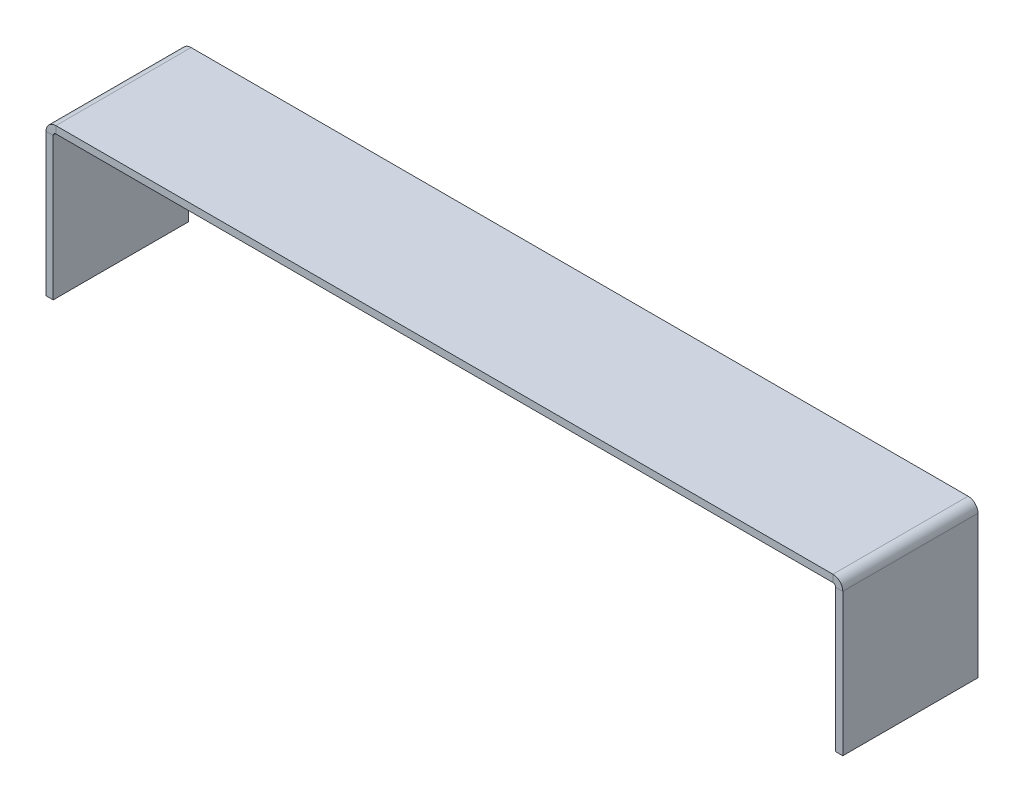
ISO-10303-21;
HEADER;
FILE_DESCRIPTION(('STEP AP214'),'2;1');
FILE_NAME('part.step','',(''),(''),'','','');
FILE_SCHEMA(('AUTOMOTIVE_DESIGN { 1 0 10303 214 1 1 1 1 }'));
ENDSEC;
DATA;
#1=APPLICATION_CONTEXT('core data for automotive mechanical design processes');
#2=APPLICATION_PROTOCOL_DEFINITION('international standard','automotive_design',2000,#1);
#3=PRODUCT_CONTEXT('',#1,'mechanical');
#4=PRODUCT('Part','Part','',(#3));
#5=PRODUCT_RELATED_PRODUCT_CATEGORY('part','',(#4));
#6=PRODUCT_DEFINITION_FORMATION('','',#4);
#7=PRODUCT_DEFINITION_CONTEXT('part definition',#1,'design');
#8=PRODUCT_DEFINITION('design','',#6,#7);
#9=PRODUCT_DEFINITION_SHAPE('','',#8);
#10=(LENGTH_UNIT() NAMED_UNIT(*) SI_UNIT(.MILLI.,.METRE.));
#11=(NAMED_UNIT(*) PLANE_ANGLE_UNIT() SI_UNIT($,.RADIAN.));
#12=(NAMED_UNIT(*) SI_UNIT($,.STERADIAN.) SOLID_ANGLE_UNIT());
#13=UNCERTAINTY_MEASURE_WITH_UNIT(LENGTH_MEASURE(1.E-05),#10,'distance_accuracy_value','');
#14=(GEOMETRIC_REPRESENTATION_CONTEXT(3) GLOBAL_UNCERTAINTY_ASSIGNED_CONTEXT((#13)) GLOBAL_UNIT_ASSIGNED_CONTEXT((#10,
#11,#12)) REPRESENTATION_CONTEXT('',''));
#15=CARTESIAN_POINT('',(0.,0.,0.));
#16=DIRECTION('',(0.,0.,1.));
#17=DIRECTION('',(1.,0.,0.));
#18=AXIS2_PLACEMENT_3D('',#15,#16,#17);
#19=CARTESIAN_POINT('',(150.,-2.,18.75));
#20=DIRECTION('',(0.,0.,1.));
#21=DIRECTION('',(1.,0.,0.));
#22=AXIS2_PLACEMENT_3D('',#19,#20,#21);
#23=PLANE('',#22);
#24=DIRECTION('',(-1.,0.,0.));
#25=VECTOR('',#24,1.);
#26=CARTESIAN_POINT('',(150.,-2.,18.75));
#27=LINE('',#26,#25);
#28=CARTESIAN_POINT('',(107.7634,-2.,18.75));
#29=VERTEX_POINT('',#28);
#30=CARTESIAN_POINT('',(-107.7634,-2.,18.75));
#31=VERTEX_POINT('',#30);
#32=EDGE_CURVE('E68',#29,#31,#27,.T.);
#33=ORIENTED_EDGE('',*,*,#32,.F.);
#34=DIRECTION('',(0.,1.,0.));
#35=VECTOR('',#34,1.);
#36=CARTESIAN_POINT('',(107.7634,-2.,18.75));
#37=LINE('',#36,#35);
#38=CARTESIAN_POINT('',(107.7634,0.,18.75));
#39=VERTEX_POINT('',#38);
#40=EDGE_CURVE('E242',#29,#39,#37,.T.);
#41=ORIENTED_EDGE('',*,*,#40,.T.);
#42=DIRECTION('',(-1.,0.,0.));
#43=VECTOR('',#42,1.);
#44=CARTESIAN_POINT('',(150.,0.,18.75));
#45=LINE('',#44,#43);
#46=CARTESIAN_POINT('',(-107.7634,0.,18.75));
#47=VERTEX_POINT('',#46);
#48=EDGE_CURVE('E247',#39,#47,#45,.T.);
#49=ORIENTED_EDGE('',*,*,#48,.T.);
#50=DIRECTION('',(0.,1.,0.));
#51=VECTOR('',#50,1.);
#52=CARTESIAN_POINT('',(-107.7634,-2.,18.75));
#53=LINE('',#52,#51);
#54=EDGE_CURVE('E236',#31,#47,#53,.T.);
#55=ORIENTED_EDGE('',*,*,#54,.F.);
#56=EDGE_LOOP('',(#33,#41,#49,#55));
#57=FACE_BOUND('',#56,.T.);
#58=ADVANCED_FACE('F45',(#57),#23,.T.);
#59=CARTESIAN_POINT('',(150.,0.,18.75));
#60=DIRECTION('',(0.,1.,0.));
#61=DIRECTION('',(0.,0.,1.));
#62=AXIS2_PLACEMENT_3D('',#59,#60,#61);
#63=PLANE('',#62);
#64=ORIENTED_EDGE('',*,*,#48,.F.);
#65=DIRECTION('',(0.,0.,-1.));
#66=VECTOR('',#65,1.);
#67=CARTESIAN_POINT('',(107.7634,0.,18.75));
#68=LINE('',#67,#66);
#69=CARTESIAN_POINT('',(107.7634,0.,-18.75));
#70=VERTEX_POINT('',#69);
#71=EDGE_CURVE('E239',#39,#70,#68,.T.);
#72=ORIENTED_EDGE('',*,*,#71,.T.);
#73=DIRECTION('',(-1.,0.,0.));
#74=VECTOR('',#73,1.);
#75=CARTESIAN_POINT('',(150.,0.,-18.75));
#76=LINE('',#75,#74);
#77=CARTESIAN_POINT('',(-107.7634,0.,-18.75));
#78=VERTEX_POINT('',#77);
#79=EDGE_CURVE('E49',#70,#78,#76,.T.);
#80=ORIENTED_EDGE('',*,*,#79,.T.);
#81=DIRECTION('',(0.,0.,-1.));
#82=VECTOR('',#81,1.);
#83=CARTESIAN_POINT('',(-107.7634,0.,18.75));
#84=LINE('',#83,#82);
#85=EDGE_CURVE('E227',#47,#78,#84,.T.);
#86=ORIENTED_EDGE('',*,*,#85,.F.);
#87=EDGE_LOOP('',(#64,#72,#80,#86));
#88=FACE_BOUND('',#87,.T.);
#89=ADVANCED_FACE('F254',(#88),#63,.T.);
#90=CARTESIAN_POINT('',(150.,0.,-18.75));
#91=DIRECTION('',(0.,0.,-1.));
#92=DIRECTION('',(-1.,0.,0.));
#93=AXIS2_PLACEMENT_3D('',#90,#91,#92);
#94=PLANE('',#93);
#95=ORIENTED_EDGE('',*,*,#79,.F.);
#96=DIRECTION('',(0.,-1.,0.));
#97=VECTOR('',#96,1.);
#98=CARTESIAN_POINT('',(107.7634,0.,-18.75));
#99=LINE('',#98,#97);
#100=CARTESIAN_POINT('',(107.7634,-2.,-18.75));
#101=VERTEX_POINT('',#100);
#102=EDGE_CURVE('E12',#70,#101,#99,.T.);
#103=ORIENTED_EDGE('',*,*,#102,.T.);
#104=DIRECTION('',(-1.,0.,0.));
#105=VECTOR('',#104,1.);
#106=CARTESIAN_POINT('',(150.,-2.,-18.75));
#107=LINE('',#106,#105);
#108=CARTESIAN_POINT('',(-107.7634,-2.,-18.75));
#109=VERTEX_POINT('',#108);
#110=EDGE_CURVE('E231',#101,#109,#107,.T.);
#111=ORIENTED_EDGE('',*,*,#110,.T.);
#112=DIRECTION('',(0.,-1.,0.));
#113=VECTOR('',#112,1.);
#114=CARTESIAN_POINT('',(-107.7634,0.,-18.75));
#115=LINE('',#114,#113);
#116=EDGE_CURVE('E230',#78,#109,#115,.T.);
#117=ORIENTED_EDGE('',*,*,#116,.F.);
#118=EDGE_LOOP('',(#95,#103,#111,#117));
#119=FACE_BOUND('',#118,.T.);
#120=ADVANCED_FACE('F47',(#119),#94,.T.);
#121=CARTESIAN_POINT('',(150.,-2.,18.75));
#122=DIRECTION('',(0.,1.,0.));
#123=DIRECTION('',(0.,0.,1.));
#124=AXIS2_PLACEMENT_3D('',#121,#122,#123);
#125=PLANE('',#124);
#126=DIRECTION('',(0.,0.,-1.));
#127=VECTOR('',#126,1.);
#128=CARTESIAN_POINT('',(107.7634,-2.,18.75));
#129=LINE('',#128,#127);
#130=EDGE_CURVE('E54',#29,#101,#129,.T.);
#131=ORIENTED_EDGE('',*,*,#130,.F.);
#132=ORIENTED_EDGE('',*,*,#32,.T.);
#133=DIRECTION('',(0.,0.,-1.));
#134=VECTOR('',#133,1.);
#135=CARTESIAN_POINT('',(-107.7634,-2.,18.75));
#136=LINE('',#135,#134);
#137=EDGE_CURVE('E234',#31,#109,#136,.T.);
#138=ORIENTED_EDGE('',*,*,#137,.T.);
#139=ORIENTED_EDGE('',*,*,#110,.F.);
#140=EDGE_LOOP('',(#131,#132,#138,#139));
#141=FACE_BOUND('',#140,.T.);
#142=ADVANCED_FACE('F307',(#141),#125,.F.);
#143=CARTESIAN_POINT('',(-107.7634,-2.7366,18.75));
#144=DIRECTION('',(0.,0.,1.));
#145=DIRECTION('',(1.,0.,0.));
#146=AXIS2_PLACEMENT_3D('',#143,#144,#145);
#147=PLANE('',#146);
#148=DIRECTION('',(-1.,0.,0.));
#149=VECTOR('',#148,1.);
#150=CARTESIAN_POINT('',(-108.5,-2.73659999999999,18.75));
#151=LINE('',#150,#149);
#152=CARTESIAN_POINT('',(-108.5,-2.73659999999999,18.75));
#153=VERTEX_POINT('',#152);
#154=CARTESIAN_POINT('',(-110.5,-2.73659999999997,18.75));
#155=VERTEX_POINT('',#154);
#156=EDGE_CURVE('E189',#153,#155,#151,.T.);
#157=ORIENTED_EDGE('',*,*,#156,.F.);
#158=CARTESIAN_POINT('',(-107.7634,-2.7366,18.75));
#159=DIRECTION('',(0.,0.,1.));
#160=DIRECTION('',(1.,0.,0.));
#161=AXIS2_PLACEMENT_3D('',#158,#159,#160);
#162=CIRCLE('',#161,0.7366);
#163=EDGE_CURVE('E188',#153,#31,#162,.F.);
#164=ORIENTED_EDGE('',*,*,#163,.T.);
#165=ORIENTED_EDGE('',*,*,#54,.T.);
#166=CARTESIAN_POINT('',(-107.7634,-2.7366,18.75));
#167=DIRECTION('',(0.,0.,-1.));
#168=DIRECTION('',(1.,0.,0.));
#169=AXIS2_PLACEMENT_3D('',#166,#167,#168);
#170=CIRCLE('',#169,2.7366);
#171=EDGE_CURVE('E216',#155,#47,#170,.T.);
#172=ORIENTED_EDGE('',*,*,#171,.F.);
#173=EDGE_LOOP('',(#157,#164,#165,#172));
#174=FACE_BOUND('',#173,.T.);
#175=ADVANCED_FACE('F281',(#174),#147,.T.);
#176=CARTESIAN_POINT('',(-107.7634,-2.7366,-18.75));
#177=DIRECTION('',(0.,0.,-1.));
#178=DIRECTION('',(-1.,0.,0.));
#179=AXIS2_PLACEMENT_3D('',#176,#177,#178);
#180=PLANE('',#179);
#181=CARTESIAN_POINT('',(-107.7634,-2.7366,-18.75));
#182=DIRECTION('',(0.,0.,1.));
#183=DIRECTION('',(1.,0.,0.));
#184=AXIS2_PLACEMENT_3D('',#181,#182,#183);
#185=CIRCLE('',#184,0.7366);
#186=CARTESIAN_POINT('',(-108.5,-2.73659999999999,-18.75));
#187=VERTEX_POINT('',#186);
#188=EDGE_CURVE('E220',#109,#187,#185,.T.);
#189=ORIENTED_EDGE('',*,*,#188,.T.);
#190=DIRECTION('',(1.,0.,0.));
#191=VECTOR('',#190,1.);
#192=CARTESIAN_POINT('',(-110.5,-2.73660000000001,-18.75));
#193=LINE('',#192,#191);
#194=CARTESIAN_POINT('',(-110.5,-2.73660000000001,-18.75));
#195=VERTEX_POINT('',#194);
#196=EDGE_CURVE('E198',#195,#187,#193,.T.);
#197=ORIENTED_EDGE('',*,*,#196,.F.);
#198=CARTESIAN_POINT('',(-107.7634,-2.7366,-18.75));
#199=DIRECTION('',(0.,0.,1.));
#200=DIRECTION('',(1.,0.,0.));
#201=AXIS2_PLACEMENT_3D('',#198,#199,#200);
#202=CIRCLE('',#201,2.7366);
#203=EDGE_CURVE('E219',#78,#195,#202,.T.);
#204=ORIENTED_EDGE('',*,*,#203,.F.);
#205=ORIENTED_EDGE('',*,*,#116,.T.);
#206=EDGE_LOOP('',(#189,#197,#204,#205));
#207=FACE_BOUND('',#206,.T.);
#208=ADVANCED_FACE('F266',(#207),#180,.T.);
#209=CARTESIAN_POINT('',(-107.7634,-2.7366,-37.652239479273));
#210=DIRECTION('',(0.,0.,1.));
#211=DIRECTION('',(1.,0.,0.));
#212=AXIS2_PLACEMENT_3D('',#209,#210,#211);
#213=CYLINDRICAL_SURFACE('',#212,2.7366);
#214=ORIENTED_EDGE('',*,*,#85,.T.);
#215=ORIENTED_EDGE('',*,*,#203,.T.);
#216=DIRECTION('',(0.,0.,-1.));
#217=VECTOR('',#216,1.);
#218=CARTESIAN_POINT('',(-110.5,-2.73660000000001,18.75));
#219=LINE('',#218,#217);
#220=EDGE_CURVE('E203',#155,#195,#219,.T.);
#221=ORIENTED_EDGE('',*,*,#220,.F.);
#222=ORIENTED_EDGE('',*,*,#171,.T.);
#223=EDGE_LOOP('',(#214,#215,#221,#222));
#224=FACE_BOUND('',#223,.T.);
#225=ADVANCED_FACE('F262',(#224),#213,.T.);
#226=CARTESIAN_POINT('',(-107.7634,-2.7366,-37.652239479273));
#227=DIRECTION('',(0.,0.,1.));
#228=DIRECTION('',(1.,0.,0.));
#229=AXIS2_PLACEMENT_3D('',#226,#227,#228);
#230=CYLINDRICAL_SURFACE('',#229,0.7366);
#231=ORIENTED_EDGE('',*,*,#137,.F.);
#232=ORIENTED_EDGE('',*,*,#163,.F.);
#233=DIRECTION('',(0.,0.,-1.));
#234=VECTOR('',#233,1.);
#235=CARTESIAN_POINT('',(-108.5,-2.73659999999999,18.75));
#236=LINE('',#235,#234);
#237=EDGE_CURVE('E181',#153,#187,#236,.T.);
#238=ORIENTED_EDGE('',*,*,#237,.T.);
#239=ORIENTED_EDGE('',*,*,#188,.F.);
#240=EDGE_LOOP('',(#231,#232,#238,#239));
#241=FACE_BOUND('',#240,.T.);
#242=ADVANCED_FACE('F275',(#241),#230,.F.);
#243=CARTESIAN_POINT('',(-110.5,-42.245355098888,0.));
#244=DIRECTION('',(0.,-1.,0.));
#245=DIRECTION('',(0.,0.,1.));
#246=AXIS2_PLACEMENT_3D('',#243,#244,#245);
#247=PLANE('',#246);
#248=DIRECTION('',(0.,0.,-1.));
#249=VECTOR('',#248,1.);
#250=CARTESIAN_POINT('',(-108.5,-42.245355098888,18.75));
#251=LINE('',#250,#249);
#252=CARTESIAN_POINT('',(-108.5,-42.245355098888,18.75));
#253=VERTEX_POINT('',#252);
#254=CARTESIAN_POINT('',(-108.5,-42.245355098888,-18.75));
#255=VERTEX_POINT('',#254);
#256=EDGE_CURVE('E191',#253,#255,#251,.T.);
#257=ORIENTED_EDGE('',*,*,#256,.F.);
#258=DIRECTION('',(-1.,0.,0.));
#259=VECTOR('',#258,1.);
#260=CARTESIAN_POINT('',(-108.5,-42.245355098888,18.75));
#261=LINE('',#260,#259);
#262=CARTESIAN_POINT('',(-110.5,-42.245355098888,18.75));
#263=VERTEX_POINT('',#262);
#264=EDGE_CURVE('E211',#253,#263,#261,.T.);
#265=ORIENTED_EDGE('',*,*,#264,.T.);
#266=DIRECTION('',(0.,0.,-1.));
#267=VECTOR('',#266,1.);
#268=CARTESIAN_POINT('',(-110.5,-42.245355098888,18.75));
#269=LINE('',#268,#267);
#270=CARTESIAN_POINT('',(-110.5,-42.245355098888,-18.75));
#271=VERTEX_POINT('',#270);
#272=EDGE_CURVE('E208',#263,#271,#269,.T.);
#273=ORIENTED_EDGE('',*,*,#272,.T.);
#274=DIRECTION('',(1.,0.,0.));
#275=VECTOR('',#274,1.);
#276=CARTESIAN_POINT('',(-110.5,-42.245355098888,-18.75));
#277=LINE('',#276,#275);
#278=EDGE_CURVE('E205',#271,#255,#277,.T.);
#279=ORIENTED_EDGE('',*,*,#278,.T.);
#280=EDGE_LOOP('',(#257,#265,#273,#279));
#281=FACE_BOUND('',#280,.T.);
#282=ADVANCED_FACE('F290',(#281),#247,.T.);
#283=CARTESIAN_POINT('',(-110.500000000001,257.754644901112,18.75));
#284=DIRECTION('',(-1.,0.,0.));
#285=DIRECTION('',(0.,0.,1.));
#286=AXIS2_PLACEMENT_3D('',#283,#284,#285);
#287=PLANE('',#286);
#288=DIRECTION('',(0.,-1.,0.));
#289=VECTOR('',#288,1.);
#290=CARTESIAN_POINT('',(-110.500000000001,257.754644901112,18.75));
#291=LINE('',#290,#289);
#292=EDGE_CURVE('E186',#155,#263,#291,.T.);
#293=ORIENTED_EDGE('',*,*,#292,.F.);
#294=ORIENTED_EDGE('',*,*,#220,.T.);
#295=DIRECTION('',(0.,-1.,0.));
#296=VECTOR('',#295,1.);
#297=CARTESIAN_POINT('',(-110.500000000001,257.754644901112,-18.75));
#298=LINE('',#297,#296);
#299=EDGE_CURVE('E201',#195,#271,#298,.T.);
#300=ORIENTED_EDGE('',*,*,#299,.T.);
#301=ORIENTED_EDGE('',*,*,#272,.F.);
#302=EDGE_LOOP('',(#293,#294,#300,#301));
#303=FACE_BOUND('',#302,.T.);
#304=ADVANCED_FACE('F288',(#303),#287,.T.);
#305=CARTESIAN_POINT('',(-110.500000000001,257.754644901112,-18.75));
#306=DIRECTION('',(0.,0.,-1.));
#307=DIRECTION('',(0.,-1.,0.));
#308=AXIS2_PLACEMENT_3D('',#305,#306,#307);
#309=PLANE('',#308);
#310=ORIENTED_EDGE('',*,*,#299,.F.);
#311=ORIENTED_EDGE('',*,*,#196,.T.);
#312=DIRECTION('',(0.,-1.,0.));
#313=VECTOR('',#312,1.);
#314=CARTESIAN_POINT('',(-108.500000000001,257.754644901112,-18.75));
#315=LINE('',#314,#313);
#316=EDGE_CURVE('E196',#187,#255,#315,.T.);
#317=ORIENTED_EDGE('',*,*,#316,.T.);
#318=ORIENTED_EDGE('',*,*,#278,.F.);
#319=EDGE_LOOP('',(#310,#311,#317,#318));
#320=FACE_BOUND('',#319,.T.);
#321=ADVANCED_FACE('F269',(#320),#309,.T.);
#322=CARTESIAN_POINT('',(-108.500000000001,257.754644901112,18.75));
#323=DIRECTION('',(-1.,0.,0.));
#324=DIRECTION('',(0.,0.,1.));
#325=AXIS2_PLACEMENT_3D('',#322,#323,#324);
#326=PLANE('',#325);
#327=ORIENTED_EDGE('',*,*,#237,.F.);
#328=DIRECTION('',(0.,-1.,0.));
#329=VECTOR('',#328,1.);
#330=CARTESIAN_POINT('',(-108.500000000001,257.754644901112,18.75));
#331=LINE('',#330,#329);
#332=EDGE_CURVE('E194',#153,#253,#331,.T.);
#333=ORIENTED_EDGE('',*,*,#332,.T.);
#334=ORIENTED_EDGE('',*,*,#256,.T.);
#335=ORIENTED_EDGE('',*,*,#316,.F.);
#336=EDGE_LOOP('',(#327,#333,#334,#335));
#337=FACE_BOUND('',#336,.T.);
#338=ADVANCED_FACE('F278',(#337),#326,.F.);
#339=CARTESIAN_POINT('',(-108.500000000001,257.754644901112,18.75));
#340=DIRECTION('',(0.,0.,1.));
#341=DIRECTION('',(0.,1.,0.));
#342=AXIS2_PLACEMENT_3D('',#339,#340,#341);
#343=PLANE('',#342);
#344=ORIENTED_EDGE('',*,*,#332,.F.);
#345=ORIENTED_EDGE('',*,*,#156,.T.);
#346=ORIENTED_EDGE('',*,*,#292,.T.);
#347=ORIENTED_EDGE('',*,*,#264,.F.);
#348=EDGE_LOOP('',(#344,#345,#346,#347));
#349=FACE_BOUND('',#348,.T.);
#350=ADVANCED_FACE('F284',(#349),#343,.T.);
#351=CARTESIAN_POINT('',(107.7634,-2.7366,18.75));
#352=DIRECTION('',(0.,0.,1.));
#353=DIRECTION('',(1.,0.,0.));
#354=AXIS2_PLACEMENT_3D('',#351,#352,#353);
#355=PLANE('',#354);
#356=ORIENTED_EDGE('',*,*,#40,.F.);
#357=CARTESIAN_POINT('',(107.7634,-2.7366,18.75));
#358=DIRECTION('',(0.,0.,-1.));
#359=DIRECTION('',(-1.,0.,0.));
#360=AXIS2_PLACEMENT_3D('',#357,#358,#359);
#361=CIRCLE('',#360,0.7366);
#362=CARTESIAN_POINT('',(108.5,-2.73659999999999,18.75));
#363=VERTEX_POINT('',#362);
#364=EDGE_CURVE('E183',#29,#363,#361,.T.);
#365=ORIENTED_EDGE('',*,*,#364,.T.);
#366=DIRECTION('',(1.,0.,0.));
#367=VECTOR('',#366,1.);
#368=CARTESIAN_POINT('',(108.5,-2.73659999999999,18.75));
#369=LINE('',#368,#367);
#370=CARTESIAN_POINT('',(110.5,-2.73660000000001,18.75));
#371=VERTEX_POINT('',#370);
#372=EDGE_CURVE('E165',#363,#371,#369,.T.);
#373=ORIENTED_EDGE('',*,*,#372,.T.);
#374=CARTESIAN_POINT('',(107.7634,-2.7366,18.75));
#375=DIRECTION('',(0.,0.,-1.));
#376=DIRECTION('',(1.,0.,0.));
#377=AXIS2_PLACEMENT_3D('',#374,#375,#376);
#378=CIRCLE('',#377,2.7366);
#379=EDGE_CURVE('E174',#39,#371,#378,.T.);
#380=ORIENTED_EDGE('',*,*,#379,.F.);
#381=EDGE_LOOP('',(#356,#365,#373,#380));
#382=FACE_BOUND('',#381,.T.);
#383=ADVANCED_FACE('F326',(#382),#355,.T.);
#384=CARTESIAN_POINT('',(107.7634,-2.7366,-18.75));
#385=DIRECTION('',(0.,0.,-1.));
#386=DIRECTION('',(-1.,0.,0.));
#387=AXIS2_PLACEMENT_3D('',#384,#385,#386);
#388=PLANE('',#387);
#389=DIRECTION('',(-1.,0.,0.));
#390=VECTOR('',#389,1.);
#391=CARTESIAN_POINT('',(110.5,-2.73660000000001,-18.75));
#392=LINE('',#391,#390);
#393=CARTESIAN_POINT('',(110.5,-2.73660000000001,-18.75));
#394=VERTEX_POINT('',#393);
#395=CARTESIAN_POINT('',(108.5,-2.73659999999999,-18.75));
#396=VERTEX_POINT('',#395);
#397=EDGE_CURVE('E143',#394,#396,#392,.T.);
#398=ORIENTED_EDGE('',*,*,#397,.T.);
#399=CARTESIAN_POINT('',(107.7634,-2.7366,-18.75));
#400=DIRECTION('',(0.,0.,-1.));
#401=DIRECTION('',(-1.,0.,0.));
#402=AXIS2_PLACEMENT_3D('',#399,#400,#401);
#403=CIRCLE('',#402,0.7366);
#404=EDGE_CURVE('E178',#396,#101,#403,.F.);
#405=ORIENTED_EDGE('',*,*,#404,.T.);
#406=ORIENTED_EDGE('',*,*,#102,.F.);
#407=CARTESIAN_POINT('',(107.7634,-2.7366,-18.75));
#408=DIRECTION('',(0.,0.,1.));
#409=DIRECTION('',(1.,0.,0.));
#410=AXIS2_PLACEMENT_3D('',#407,#408,#409);
#411=CIRCLE('',#410,2.7366);
#412=EDGE_CURVE('E177',#394,#70,#411,.T.);
#413=ORIENTED_EDGE('',*,*,#412,.F.);
#414=EDGE_LOOP('',(#398,#405,#406,#413));
#415=FACE_BOUND('',#414,.T.);
#416=ADVANCED_FACE('F316',(#415),#388,.T.);
#417=CARTESIAN_POINT('',(107.7634,-2.7366,37.652239479273));
#418=DIRECTION('',(0.,0.,-1.));
#419=DIRECTION('',(-1.,0.,0.));
#420=AXIS2_PLACEMENT_3D('',#417,#418,#419);
#421=CYLINDRICAL_SURFACE('',#420,2.7366);
#422=ORIENTED_EDGE('',*,*,#412,.T.);
#423=ORIENTED_EDGE('',*,*,#71,.F.);
#424=ORIENTED_EDGE('',*,*,#379,.T.);
#425=DIRECTION('',(0.,0.,-1.));
#426=VECTOR('',#425,1.);
#427=CARTESIAN_POINT('',(110.5,-2.73660000000001,18.75));
#428=LINE('',#427,#426);
#429=EDGE_CURVE('E172',#371,#394,#428,.T.);
#430=ORIENTED_EDGE('',*,*,#429,.T.);
#431=EDGE_LOOP('',(#422,#423,#424,#430));
#432=FACE_BOUND('',#431,.T.);
#433=ADVANCED_FACE('F318',(#432),#421,.T.);
#434=CARTESIAN_POINT('',(107.7634,-2.7366,37.652239479273));
#435=DIRECTION('',(0.,0.,-1.));
#436=DIRECTION('',(-1.,0.,0.));
#437=AXIS2_PLACEMENT_3D('',#434,#435,#436);
#438=CYLINDRICAL_SURFACE('',#437,0.7366);
#439=ORIENTED_EDGE('',*,*,#404,.F.);
#440=DIRECTION('',(0.,0.,-1.));
#441=VECTOR('',#440,1.);
#442=CARTESIAN_POINT('',(108.5,-2.73659999999999,18.75));
#443=LINE('',#442,#441);
#444=EDGE_CURVE('E159',#363,#396,#443,.T.);
#445=ORIENTED_EDGE('',*,*,#444,.F.);
#446=ORIENTED_EDGE('',*,*,#364,.F.);
#447=ORIENTED_EDGE('',*,*,#130,.T.);
#448=EDGE_LOOP('',(#439,#445,#446,#447));
#449=FACE_BOUND('',#448,.T.);
#450=ADVANCED_FACE('F327',(#449),#438,.F.);
#451=CARTESIAN_POINT('',(110.5,-42.2453550988879,0.));
#452=DIRECTION('',(0.,1.,0.));
#453=DIRECTION('',(0.,0.,1.));
#454=AXIS2_PLACEMENT_3D('',#451,#452,#453);
#455=PLANE('',#454);
#456=DIRECTION('',(0.,0.,-1.));
#457=VECTOR('',#456,1.);
#458=CARTESIAN_POINT('',(108.5,-42.2453550988879,18.75));
#459=LINE('',#458,#457);
#460=CARTESIAN_POINT('',(108.5,-42.2453550988879,18.75));
#461=VERTEX_POINT('',#460);
#462=CARTESIAN_POINT('',(108.5,-42.2453550988879,-18.75));
#463=VERTEX_POINT('',#462);
#464=EDGE_CURVE('E156',#461,#463,#459,.T.);
#465=ORIENTED_EDGE('',*,*,#464,.T.);
#466=DIRECTION('',(-1.,0.,0.));
#467=VECTOR('',#466,1.);
#468=CARTESIAN_POINT('',(110.5,-42.2453550988879,-18.75));
#469=LINE('',#468,#467);
#470=CARTESIAN_POINT('',(110.5,-42.2453550988879,-18.75));
#471=VERTEX_POINT('',#470);
#472=EDGE_CURVE('E141',#471,#463,#469,.T.);
#473=ORIENTED_EDGE('',*,*,#472,.F.);
#474=DIRECTION('',(0.,0.,-1.));
#475=VECTOR('',#474,1.);
#476=CARTESIAN_POINT('',(110.5,-42.2453550988879,18.75));
#477=LINE('',#476,#475);
#478=CARTESIAN_POINT('',(110.5,-42.2453550988879,18.75));
#479=VERTEX_POINT('',#478);
#480=EDGE_CURVE('E148',#479,#471,#477,.T.);
#481=ORIENTED_EDGE('',*,*,#480,.F.);
#482=DIRECTION('',(1.,0.,0.));
#483=VECTOR('',#482,1.);
#484=CARTESIAN_POINT('',(108.5,-42.2453550988879,18.75));
#485=LINE('',#484,#483);
#486=EDGE_CURVE('E147',#461,#479,#485,.T.);
#487=ORIENTED_EDGE('',*,*,#486,.F.);
#488=EDGE_LOOP('',(#465,#473,#481,#487));
#489=FACE_BOUND('',#488,.T.);
#490=ADVANCED_FACE('F152',(#489),#455,.F.);
#491=CARTESIAN_POINT('',(110.5,-42.2453550988879,18.75));
#492=DIRECTION('',(1.,0.,0.));
#493=DIRECTION('',(0.,0.,1.));
#494=AXIS2_PLACEMENT_3D('',#491,#492,#493);
#495=PLANE('',#494);
#496=ORIENTED_EDGE('',*,*,#429,.F.);
#497=DIRECTION('',(0.,1.,0.));
#498=VECTOR('',#497,1.);
#499=CARTESIAN_POINT('',(110.5,-42.2453550988879,18.75));
#500=LINE('',#499,#498);
#501=EDGE_CURVE('E163',#479,#371,#500,.T.);
#502=ORIENTED_EDGE('',*,*,#501,.F.);
#503=ORIENTED_EDGE('',*,*,#480,.T.);
#504=DIRECTION('',(0.,1.,0.));
#505=VECTOR('',#504,1.);
#506=CARTESIAN_POINT('',(110.5,-42.2453550988879,-18.75));
#507=LINE('',#506,#505);
#508=EDGE_CURVE('E138',#471,#394,#507,.T.);
#509=ORIENTED_EDGE('',*,*,#508,.T.);
#510=EDGE_LOOP('',(#496,#502,#503,#509));
#511=FACE_BOUND('',#510,.T.);
#512=ADVANCED_FACE('F161',(#511),#495,.T.);
#513=CARTESIAN_POINT('',(108.5,-42.2453550988879,18.75));
#514=DIRECTION('',(0.,0.,1.));
#515=DIRECTION('',(0.,-1.,0.));
#516=AXIS2_PLACEMENT_3D('',#513,#514,#515);
#517=PLANE('',#516);
#518=ORIENTED_EDGE('',*,*,#372,.F.);
#519=DIRECTION('',(0.,1.,0.));
#520=VECTOR('',#519,1.);
#521=CARTESIAN_POINT('',(108.5,-42.2453550988879,18.75));
#522=LINE('',#521,#520);
#523=EDGE_CURVE('E323',#461,#363,#522,.T.);
#524=ORIENTED_EDGE('',*,*,#523,.F.);
#525=ORIENTED_EDGE('',*,*,#486,.T.);
#526=ORIENTED_EDGE('',*,*,#501,.T.);
#527=EDGE_LOOP('',(#518,#524,#525,#526));
#528=FACE_BOUND('',#527,.T.);
#529=ADVANCED_FACE('F321',(#528),#517,.T.);
#530=CARTESIAN_POINT('',(108.5,-42.2453550988879,18.75));
#531=DIRECTION('',(1.,0.,0.));
#532=DIRECTION('',(0.,0.,1.));
#533=AXIS2_PLACEMENT_3D('',#530,#531,#532);
#534=PLANE('',#533);
#535=ORIENTED_EDGE('',*,*,#523,.T.);
#536=ORIENTED_EDGE('',*,*,#444,.T.);
#537=DIRECTION('',(0.,1.,0.));
#538=VECTOR('',#537,1.);
#539=CARTESIAN_POINT('',(108.5,-42.2453550988879,-18.75));
#540=LINE('',#539,#538);
#541=EDGE_CURVE('E158',#463,#396,#540,.T.);
#542=ORIENTED_EDGE('',*,*,#541,.F.);
#543=ORIENTED_EDGE('',*,*,#464,.F.);
#544=EDGE_LOOP('',(#535,#536,#542,#543));
#545=FACE_BOUND('',#544,.T.);
#546=ADVANCED_FACE('F333',(#545),#534,.F.);
#547=CARTESIAN_POINT('',(110.5,-42.2453550988879,-18.75));
#548=DIRECTION('',(0.,0.,-1.));
#549=DIRECTION('',(0.,1.,0.));
#550=AXIS2_PLACEMENT_3D('',#547,#548,#549);
#551=PLANE('',#550);
#552=ORIENTED_EDGE('',*,*,#397,.F.);
#553=ORIENTED_EDGE('',*,*,#508,.F.);
#554=ORIENTED_EDGE('',*,*,#472,.T.);
#555=ORIENTED_EDGE('',*,*,#541,.T.);
#556=EDGE_LOOP('',(#552,#553,#554,#555));
#557=FACE_BOUND('',#556,.T.);
#558=ADVANCED_FACE('F140',(#557),#551,.T.);
#559=CLOSED_SHELL('',(#58,#89,#120,#142,#175,#208,#225,#242,#282,#304,#321,#338,#350,#383,#416,
#433,#450,#490,#512,#529,#546,#558));
#560=MANIFOLD_SOLID_BREP('B2',#559);
#561=ADVANCED_BREP_SHAPE_REPRESENTATION('',(#18,#560),#14);
#562=SHAPE_DEFINITION_REPRESENTATION(#9,#561);
ENDSEC;
END-ISO-10303-21;
